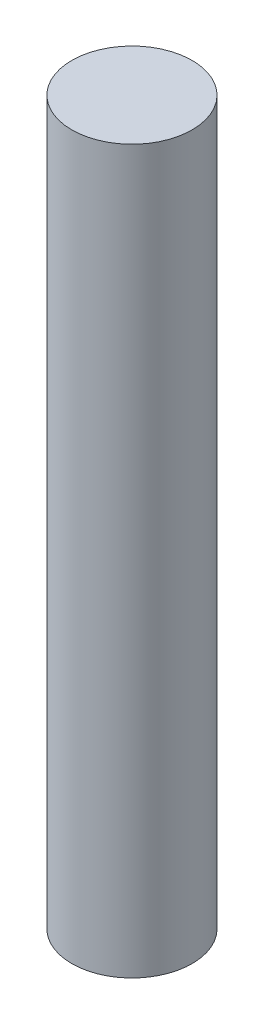
ISO-10303-21;
HEADER;
FILE_DESCRIPTION(('STEP AP214'),'2;1');
FILE_NAME('part.step','',(''),(''),'','','');
FILE_SCHEMA(('AUTOMOTIVE_DESIGN { 1 0 10303 214 1 1 1 1 }'));
ENDSEC;
DATA;
#1=APPLICATION_CONTEXT('core data for automotive mechanical design processes');
#2=APPLICATION_PROTOCOL_DEFINITION('international standard','automotive_design',2000,#1);
#3=PRODUCT_CONTEXT('',#1,'mechanical');
#4=PRODUCT('Part','Part','',(#3));
#5=PRODUCT_RELATED_PRODUCT_CATEGORY('part','',(#4));
#6=PRODUCT_DEFINITION_FORMATION('','',#4);
#7=PRODUCT_DEFINITION_CONTEXT('part definition',#1,'design');
#8=PRODUCT_DEFINITION('design','',#6,#7);
#9=PRODUCT_DEFINITION_SHAPE('','',#8);
#10=(LENGTH_UNIT() NAMED_UNIT(*) SI_UNIT(.MILLI.,.METRE.));
#11=(NAMED_UNIT(*) PLANE_ANGLE_UNIT() SI_UNIT($,.RADIAN.));
#12=(NAMED_UNIT(*) SI_UNIT($,.STERADIAN.) SOLID_ANGLE_UNIT());
#13=UNCERTAINTY_MEASURE_WITH_UNIT(LENGTH_MEASURE(1.E-05),#10,'distance_accuracy_value','');
#14=(GEOMETRIC_REPRESENTATION_CONTEXT(3) GLOBAL_UNCERTAINTY_ASSIGNED_CONTEXT((#13)) GLOBAL_UNIT_ASSIGNED_CONTEXT((#10,
#11,#12)) REPRESENTATION_CONTEXT('',''));
#15=CARTESIAN_POINT('',(0.,0.,0.));
#16=DIRECTION('',(0.,0.,1.));
#17=DIRECTION('',(1.,0.,0.));
#18=AXIS2_PLACEMENT_3D('',#15,#16,#17);
#19=CARTESIAN_POINT('',(0.,19.05,0.));
#20=DIRECTION('',(0.,-1.,0.));
#21=DIRECTION('',(0.,0.,-1.));
#22=AXIS2_PLACEMENT_3D('',#19,#20,#21);
#23=CYLINDRICAL_SURFACE('',#22,3.175);
#24=CARTESIAN_POINT('',(0.,19.05,0.));
#25=DIRECTION('',(0.,1.,0.));
#26=DIRECTION('',(0.,0.,1.));
#27=AXIS2_PLACEMENT_3D('',#24,#25,#26);
#28=CIRCLE('',#27,3.175);
#29=CARTESIAN_POINT('',(0.,19.05,3.175));
#30=VERTEX_POINT('',#29);
#31=EDGE_CURVE('E10',#30,#30,#28,.T.);
#32=ORIENTED_EDGE('',*,*,#31,.F.);
#33=EDGE_LOOP('',(#32));
#34=FACE_BOUND('',#33,.T.);
#35=CARTESIAN_POINT('',(0.,-19.05,0.));
#36=DIRECTION('',(0.,1.,0.));
#37=DIRECTION('',(0.,0.,1.));
#38=AXIS2_PLACEMENT_3D('',#35,#36,#37);
#39=CIRCLE('',#38,3.175);
#40=CARTESIAN_POINT('',(0.,-19.05,3.175));
#41=VERTEX_POINT('',#40);
#42=EDGE_CURVE('E33',#41,#41,#39,.T.);
#43=ORIENTED_EDGE('',*,*,#42,.T.);
#44=EDGE_LOOP('',(#43));
#45=FACE_BOUND('',#44,.T.);
#46=ADVANCED_FACE('F30',(#34,#45),#23,.T.);
#47=CARTESIAN_POINT('',(0.,19.05,0.));
#48=DIRECTION('',(0.,1.,0.));
#49=DIRECTION('',(0.,0.,1.));
#50=AXIS2_PLACEMENT_3D('',#47,#48,#49);
#51=PLANE('',#50);
#52=ORIENTED_EDGE('',*,*,#31,.T.);
#53=EDGE_LOOP('',(#52));
#54=FACE_BOUND('',#53,.T.);
#55=ADVANCED_FACE('F45',(#54),#51,.T.);
#56=CARTESIAN_POINT('',(0.,-19.05,0.));
#57=DIRECTION('',(0.,1.,0.));
#58=DIRECTION('',(0.,0.,1.));
#59=AXIS2_PLACEMENT_3D('',#56,#57,#58);
#60=PLANE('',#59);
#61=ORIENTED_EDGE('',*,*,#42,.F.);
#62=EDGE_LOOP('',(#61));
#63=FACE_BOUND('',#62,.T.);
#64=ADVANCED_FACE('F43',(#63),#60,.F.);
#65=CLOSED_SHELL('',(#46,#55,#64));
#66=MANIFOLD_SOLID_BREP('B2',#65);
#67=ADVANCED_BREP_SHAPE_REPRESENTATION('',(#18,#66),#14);
#68=SHAPE_DEFINITION_REPRESENTATION(#9,#67);
ENDSEC;
END-ISO-10303-21;
